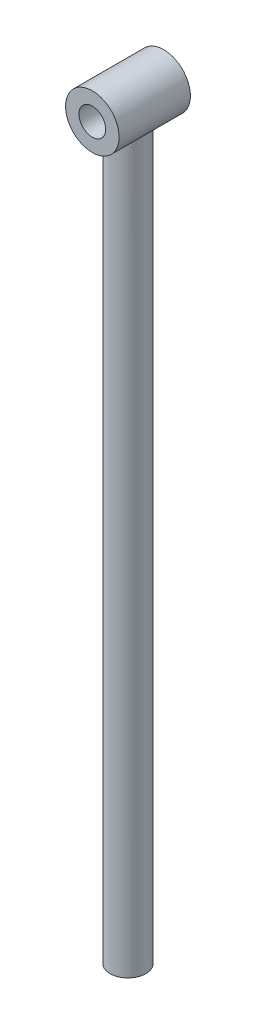
ISO-10303-21;
HEADER;
FILE_DESCRIPTION(('STEP AP214'),'2;1');
FILE_NAME('part.step','',(''),(''),'','','');
FILE_SCHEMA(('AUTOMOTIVE_DESIGN { 1 0 10303 214 1 1 1 1 }'));
ENDSEC;
DATA;
#1=APPLICATION_CONTEXT('core data for automotive mechanical design processes');
#2=APPLICATION_PROTOCOL_DEFINITION('international standard','automotive_design',2000,#1);
#3=PRODUCT_CONTEXT('',#1,'mechanical');
#4=PRODUCT('Part','Part','',(#3));
#5=PRODUCT_RELATED_PRODUCT_CATEGORY('part','',(#4));
#6=PRODUCT_DEFINITION_FORMATION('','',#4);
#7=PRODUCT_DEFINITION_CONTEXT('part definition',#1,'design');
#8=PRODUCT_DEFINITION('design','',#6,#7);
#9=PRODUCT_DEFINITION_SHAPE('','',#8);
#10=(LENGTH_UNIT() NAMED_UNIT(*) SI_UNIT(.MILLI.,.METRE.));
#11=(NAMED_UNIT(*) PLANE_ANGLE_UNIT() SI_UNIT($,.RADIAN.));
#12=(NAMED_UNIT(*) SI_UNIT($,.STERADIAN.) SOLID_ANGLE_UNIT());
#13=UNCERTAINTY_MEASURE_WITH_UNIT(LENGTH_MEASURE(1.E-05),#10,'distance_accuracy_value','');
#14=(GEOMETRIC_REPRESENTATION_CONTEXT(3) GLOBAL_UNCERTAINTY_ASSIGNED_CONTEXT((#13)) GLOBAL_UNIT_ASSIGNED_CONTEXT((#10,
#11,#12)) REPRESENTATION_CONTEXT('',''));
#15=CARTESIAN_POINT('',(0.,0.,0.));
#16=DIRECTION('',(0.,0.,1.));
#17=DIRECTION('',(1.,0.,0.));
#18=AXIS2_PLACEMENT_3D('',#15,#16,#17);
#19=CARTESIAN_POINT('',(0.,407.5,0.));
#20=DIRECTION('',(0.,-1.,0.));
#21=DIRECTION('',(0.,0.,-1.));
#22=AXIS2_PLACEMENT_3D('',#19,#20,#21);
#23=CYLINDRICAL_SURFACE('',#22,20.);
#24=CARTESIAN_POINT('',(0.,-407.5,0.));
#25=DIRECTION('',(0.,1.,0.));
#26=DIRECTION('',(0.,0.,1.));
#27=AXIS2_PLACEMENT_3D('',#24,#25,#26);
#28=CIRCLE('',#27,20.);
#29=CARTESIAN_POINT('',(0.,-407.5,20.));
#30=VERTEX_POINT('',#29);
#31=EDGE_CURVE('E10',#30,#30,#28,.T.);
#32=ORIENTED_EDGE('',*,*,#31,.T.);
#33=EDGE_LOOP('',(#32));
#34=FACE_BOUND('',#33,.T.);
#35=CARTESIAN_POINT('',(-20.,407.5,0.));
#36=CARTESIAN_POINT('',(-19.9999964119226,407.499993881469,0.488208956169299));
#37=CARTESIAN_POINT('',(-19.9820866285813,407.483938202641,0.97646829177405));
#38=CARTESIAN_POINT('',(-19.9108373861768,407.420520366488,1.94835881250642));
#39=CARTESIAN_POINT('',(-19.8574922772833,407.37315321685,2.43198924712351));
#40=CARTESIAN_POINT('',(-19.7163799196857,407.249330081078,3.39112332136816));
#41=CARTESIAN_POINT('',(-19.6285606101057,407.172830105542,3.86661352940438));
#42=CARTESIAN_POINT('',(-19.4200919600602,406.994136325158,4.80533737323532));
#43=CARTESIAN_POINT('',(-19.2994419849513,406.891942023621,5.26857077190594));
#44=CARTESIAN_POINT('',(-19.0284426273943,406.666951548009,6.17578513914899));
#45=CARTESIAN_POINT('',(-18.8783985352891,406.544368954607,6.6199111296105));
#46=CARTESIAN_POINT('',(-18.5495380856481,406.281899591076,7.49212487931458));
#47=CARTESIAN_POINT('',(-18.3707170095788,406.142009984004,7.92020999413464));
#48=CARTESIAN_POINT('',(-17.9858478768931,405.848854181399,8.75912421482547));
#49=CARTESIAN_POINT('',(-17.7798015587787,405.695588840202,9.16995442032434));
#50=CARTESIAN_POINT('',(-17.3417522052945,405.379327250868,9.97362051230805));
#51=CARTESIAN_POINT('',(-17.1097473739498,405.216330329804,10.3664551510918));
#52=CARTESIAN_POINT('',(-16.5827611461459,404.858106096038,11.1932268211757));
#53=CARTESIAN_POINT('',(-16.2835985891376,404.661811794348,11.6240409428177));
#54=CARTESIAN_POINT('',(-15.6533280846079,404.265525325374,12.4598274059487));
#55=CARTESIAN_POINT('',(-15.3222179783466,404.065532908943,12.8647979980787));
#56=CARTESIAN_POINT('',(-14.6288076134715,403.666057781119,13.6481434866574));
#57=CARTESIAN_POINT('',(-14.2664790139786,403.466575705811,14.0264936382841));
#58=CARTESIAN_POINT('',(-13.5118632099609,403.072421135302,14.7548145893199));
#59=CARTESIAN_POINT('',(-13.1195739425843,402.877748972495,15.1047834311923));
#60=CARTESIAN_POINT('',(-12.2471310095378,402.469586628632,15.8231340954399));
#61=CARTESIAN_POINT('',(-11.7624780965832,402.257450921962,16.1868495528045));
#62=CARTESIAN_POINT('',(-10.7570654072488,401.850329707228,16.8717372344808));
#63=CARTESIAN_POINT('',(-10.2363012863295,401.65534626918,17.1929043262227));
#64=CARTESIAN_POINT('',(-9.16171847148809,401.288228630514,17.7887598687195));
#65=CARTESIAN_POINT('',(-8.60792794262454,401.116075353034,18.0634871779264));
#66=CARTESIAN_POINT('',(-7.4705384998476,400.799722899068,18.5627727588207));
#67=CARTESIAN_POINT('',(-6.88694600391358,400.655517735647,18.7873417767955));
#68=CARTESIAN_POINT('',(-5.76165832972233,400.414179819596,19.1602240381012));
#69=CARTESIAN_POINT('',(-5.22260227045826,400.31358203543,19.3142641521887));
#70=CARTESIAN_POINT('',(-4.12906673821278,400.141039062266,19.5772038937651));
#71=CARTESIAN_POINT('',(-3.57458830833749,400.069091940471,19.6861065662819));
#72=CARTESIAN_POINT('',(-2.45588842993638,399.956092266056,19.8566974647913));
#73=CARTESIAN_POINT('',(-1.89167781543662,399.915007374476,19.9184351137685));
#74=CARTESIAN_POINT('',(-0.758659088769605,399.864916470831,19.9936647349202));
#75=CARTESIAN_POINT('',(-0.189851636642891,399.855905932576,20.007163514351));
#76=CARTESIAN_POINT('',(0.859806415927929,399.869132376813,19.9873184370662));
#77=CARTESIAN_POINT('',(1.34086232409546,399.886820411082,19.9607940358833));
#78=CARTESIAN_POINT('',(2.2983895351906,399.945008785724,19.873310019839));
#79=CARTESIAN_POINT('',(2.77486142184121,399.985506181407,19.8123548499873));
#80=CARTESIAN_POINT('',(3.71988287537241,400.088403326163,19.6568520909165));
#81=CARTESIAN_POINT('',(4.18843209759109,400.150804025547,19.5623030441721));
#82=CARTESIAN_POINT('',(5.11455664152083,400.296156324434,19.3408382238798));
#83=CARTESIAN_POINT('',(5.57213148802944,400.379108812098,19.2139210515152));
#84=CARTESIAN_POINT('',(6.47179810816158,400.563481074713,18.9298040334638));
#85=CARTESIAN_POINT('',(6.91394533614489,400.664824284507,18.7727295883957));
#86=CARTESIAN_POINT('',(7.78251525709053,400.884256248497,18.4296096664266));
#87=CARTESIAN_POINT('',(8.20893822800989,401.00234470651,18.2435647019401));
#88=CARTESIAN_POINT('',(9.04431763466509,401.253154002358,17.8441778455769));
#89=CARTESIAN_POINT('',(9.45327362336784,401.38587521438,17.6308352556287));
#90=CARTESIAN_POINT('',(10.2523545489443,401.663725775055,17.1784769804029));
#91=CARTESIAN_POINT('',(10.6424772661187,401.80885658075,16.9394582795807));
#92=CARTESIAN_POINT('',(11.4527356062426,402.128953034818,16.4042840153249));
#93=CARTESIAN_POINT('',(11.8700812163929,402.305333403245,16.1047473885238));
#94=CARTESIAN_POINT('',(12.6780149842778,402.66759262642,15.4767499308217));
#95=CARTESIAN_POINT('',(13.0686011478891,402.853472187254,15.1482869484778));
#96=CARTESIAN_POINT('',(13.8225619123957,403.231469234949,14.4636253470291));
#97=CARTESIAN_POINT('',(14.185896693865,403.423595283726,14.107387635318));
#98=CARTESIAN_POINT('',(14.883843396687,403.810144668192,13.3689696755022));
#99=CARTESIAN_POINT('',(15.2184538830105,404.004568118104,12.9867881329827));
#100=CARTESIAN_POINT('',(15.9077512722913,404.421931040772,12.1362208652914));
#101=CARTESIAN_POINT('',(16.2574779985587,404.64460693453,11.6636681752519));
#102=CARTESIAN_POINT('',(16.9156894234148,405.081343193447,10.6867448691347));
#103=CARTESIAN_POINT('',(17.2241648426868,405.295401612594,10.1823671315698));
#104=CARTESIAN_POINT('',(17.7972680129957,405.707386108483,9.14376134489056));
#105=CARTESIAN_POINT('',(18.0619535936899,405.905333283541,8.60957393087463));
#106=CARTESIAN_POINT('',(18.4241508744694,406.184237346206,7.7871923826137));
#107=CARTESIAN_POINT('',(18.5390641862881,406.274191016331,7.50958963683991));
#108=CARTESIAN_POINT('',(18.7569503816949,406.447090902428,6.94749503984159));
#109=CARTESIAN_POINT('',(18.8599203489511,406.530035405562,6.66300152643999));
#110=CARTESIAN_POINT('',(19.0949737019528,406.721668355833,5.96407091868973));
#111=CARTESIAN_POINT('',(19.2205883140043,406.826129834624,5.54626140545959));
#112=CARTESIAN_POINT('',(19.4450303060951,407.015278355752,4.69922231908339));
#113=CARTESIAN_POINT('',(19.5438649938583,407.099970791804,4.26999589657126));
#114=CARTESIAN_POINT('',(19.7133430846625,407.246598248626,3.40278811100767));
#115=CARTESIAN_POINT('',(19.78402675084,407.308565761701,2.96482019952329));
#116=CARTESIAN_POINT('',(19.8962732778957,407.407529766171,2.08233638909667));
#117=CARTESIAN_POINT('',(19.9378360210846,407.444526156647,1.63782046369868));
#118=CARTESIAN_POINT('',(19.9912114344644,407.492113124786,0.743602003114581));
#119=CARTESIAN_POINT('',(20.0028921020166,407.502586536412,0.293885240116592));
#120=CARTESIAN_POINT('',(19.9958970388908,407.496330466284,-0.605120297999139));
#121=CARTESIAN_POINT('',(19.9772212354264,407.479600919307,-1.0544090720881));
#122=CARTESIAN_POINT('',(19.9098452800438,407.419644392814,-1.94924286023371));
#123=CARTESIAN_POINT('',(19.8611237313693,407.376398530113,-2.3947849767472));
#124=CARTESIAN_POINT('',(19.7344995148557,407.265180410363,-3.27854030433163));
#125=CARTESIAN_POINT('',(19.6565963592159,407.197207739979,-3.71675339276237));
#126=CARTESIAN_POINT('',(19.4773587360434,407.043017262938,-4.56177482159983));
#127=CARTESIAN_POINT('',(19.3773687153742,406.957864100562,-4.96906636618391));
#128=CARTESIAN_POINT('',(19.1532490632813,406.77011012496,-5.77297690486431));
#129=CARTESIAN_POINT('',(19.0291101035355,406.66750257133,-6.16959170710488));
#130=CARTESIAN_POINT('',(18.7579126655137,406.4476244528,-6.95065639455217));
#131=CARTESIAN_POINT('',(18.6108558836455,406.330354973322,-7.33510717762392));
#132=CARTESIAN_POINT('',(18.2949037795792,406.083870826237,-8.09100392305642));
#133=CARTESIAN_POINT('',(18.1260052876392,405.95465442563,-8.46244798787665));
#134=CARTESIAN_POINT('',(17.731501269301,405.660144128327,-9.26453201163457));
#135=CARTESIAN_POINT('',(17.5013086005028,405.492800976277,-9.6921672083065));
#136=CARTESIAN_POINT('',(17.0123139239897,405.148930822038,-10.5268797585094));
#137=CARTESIAN_POINT('',(16.7535092362064,404.972402960344,-10.9339551810086));
#138=CARTESIAN_POINT('',(16.2081390990384,404.613841758583,-11.7272393872389));
#139=CARTESIAN_POINT('',(15.9215439116551,404.431802667528,-12.1134251136209));
#140=CARTESIAN_POINT('',(15.3217576930428,404.065967542722,-12.863686505644));
#141=CARTESIAN_POINT('',(15.0085648790455,403.882171391933,-13.227760686397));
#142=CARTESIAN_POINT('',(14.2850209466698,403.476104916568,-14.010022924438));
#143=CARTESIAN_POINT('',(13.868399953091,403.254209867245,-14.4226354817809));
#144=CARTESIAN_POINT('',(12.9981303927616,402.818388772539,-15.2116275793937));
#145=CARTESIAN_POINT('',(12.5444750407321,402.604464197976,-15.5880004523266));
#146=CARTESIAN_POINT('',(11.6020484650165,402.190167771347,-16.3015809622043));
#147=CARTESIAN_POINT('',(11.1133018111967,401.989786623788,-16.6388155779588));
#148=CARTESIAN_POINT('',(10.1024838029969,401.607688163368,-17.2712189380549));
#149=CARTESIAN_POINT('',(9.58042143890712,401.425965849639,-17.5663989619658));
#150=CARTESIAN_POINT('',(8.60898698059615,401.118850570919,-18.0588559388184));
#151=CARTESIAN_POINT('',(8.16491313347022,400.989342380183,-18.2640476187588));
#152=CARTESIAN_POINT('',(7.25872966066562,400.748301844028,-18.6427436665588));
#153=CARTESIAN_POINT('',(6.79662209756981,400.636767450321,-18.8162516453839));
#154=CARTESIAN_POINT('',(5.85709265439529,400.43407204083,-19.1295452645597));
#155=CARTESIAN_POINT('',(5.37968128385402,400.342897372273,-19.2693535082187));
#156=CARTESIAN_POINT('',(4.41219358714586,400.182861103737,-19.5136219644057));
#157=CARTESIAN_POINT('',(3.92211707735807,400.113999827457,-19.6180816641359));
#158=CARTESIAN_POINT('',(2.93054121015942,399.999968577332,-19.7905605262366));
#159=CARTESIAN_POINT('',(2.42900032455899,399.954906780232,-19.8584133272705));
#160=CARTESIAN_POINT('',(1.42057881685204,399.890073951116,-19.9559150035461));
#161=CARTESIAN_POINT('',(0.913698186293011,399.870302959141,-19.985563818304));
#162=CARTESIAN_POINT('',(-0.101169392531053,399.856558535049,-20.0061827922548));
#163=CARTESIAN_POINT('',(-0.609156273087103,399.862583566089,-19.9971552556599));
#164=CARTESIAN_POINT('',(-1.6219998853204,399.900274149729,-19.9405705458765));
#165=CARTESIAN_POINT('',(-2.12685675839747,399.931938535426,-19.8930151261764));
#166=CARTESIAN_POINT('',(-3.09279975247604,400.016881209177,-19.7649794259347));
#167=CARTESIAN_POINT('',(-3.55439520403422,400.06841684997,-19.687150146037));
#168=CARTESIAN_POINT('',(-4.46836902451357,400.191734722602,-19.5000321223317));
#169=CARTESIAN_POINT('',(-4.92074792756968,400.263515777541,-19.3907452072019));
#170=CARTESIAN_POINT('',(-5.81367709229976,400.425885313285,-19.1419956701691));
#171=CARTESIAN_POINT('',(-6.25422660786601,400.516474977262,-19.0025311498945));
#172=CARTESIAN_POINT('',(-7.12122590088721,400.714737794064,-18.6949126651676));
#173=CARTESIAN_POINT('',(-7.54767493283414,400.82241184842,-18.5267571866793));
#174=CARTESIAN_POINT('',(-8.40878779714676,401.059584584045,-18.1528283168398));
#175=CARTESIAN_POINT('',(-8.84250227551099,401.18998488629,-17.9454426246028));
#176=CARTESIAN_POINT('',(-9.69029143409239,401.465311567327,-17.5022026754717));
#177=CARTESIAN_POINT('',(-10.104365557902,401.610238357291,-17.2663476127158));
#178=CARTESIAN_POINT('',(-10.9116855558948,401.912139034183,-16.7678351398796));
#179=CARTESIAN_POINT('',(-11.3049224388242,402.069118051233,-16.5051663004555));
#180=CARTESIAN_POINT('',(-12.0693531593152,402.392461909335,-15.9547049296104));
#181=CARTESIAN_POINT('',(-12.4405445187535,402.558827801475,-15.6669095826824));
#182=CARTESIAN_POINT('',(-13.2166207315212,402.924963855274,-15.0204704992175));
#183=CARTESIAN_POINT('',(-13.617623044081,403.125872517489,-14.6578028483683));
#184=CARTESIAN_POINT('',(-14.3878567191196,403.532382117264,-13.9025385930368));
#185=CARTESIAN_POINT('',(-14.757083928306,403.737983663796,-13.5099380886709));
#186=CARTESIAN_POINT('',(-15.462918100534,404.14949239823,-12.6960054650691));
#187=CARTESIAN_POINT('',(-15.7995010665117,404.355399699683,-12.2746525915668));
#188=CARTESIAN_POINT('',(-16.4385088149114,404.762494367217,-11.4046784566367));
#189=CARTESIAN_POINT('',(-16.7409369054171,404.963682188907,-10.9560598425279));
#190=CARTESIAN_POINT('',(-17.288437587054,405.341057049452,-10.0678167363029));
#191=CARTESIAN_POINT('',(-17.536125801145,405.51798037407,-9.63011792851657));
#192=CARTESIAN_POINT('',(-17.9996334824726,405.858681305787,-8.73315553064819));
#193=CARTESIAN_POINT('',(-18.2154519906584,406.022458517214,-8.27389129214839));
#194=CARTESIAN_POINT('',(-18.6130511835398,406.331598449548,-7.33576452239174));
#195=CARTESIAN_POINT('',(-18.7948860714089,406.476990372712,-6.85693471063569));
#196=CARTESIAN_POINT('',(-19.1227764985235,406.744359873994,-5.88083845965278));
#197=CARTESIAN_POINT('',(-19.268841780706,406.866343826018,-5.38357708340432));
#198=CARTESIAN_POINT('',(-19.4947592055363,407.057803913261,-4.48539119124869));
#199=CARTESIAN_POINT('',(-19.5821115045836,407.13292547452,-4.08754467830019));
#200=CARTESIAN_POINT('',(-19.7327455746581,407.263584237436,-3.28415884670263));
#201=CARTESIAN_POINT('',(-19.7960310323203,407.319124438533,-2.8786207162801));
#202=CARTESIAN_POINT('',(-19.8976315087765,407.408756094694,-2.06234621278792));
#203=CARTESIAN_POINT('',(-19.9359641063474,407.442862648734,-1.65161370745006));
#204=CARTESIAN_POINT('',(-19.9871514199304,407.48848856574,-0.827266419755445));
#205=CARTESIAN_POINT('',(-20.0000030401181,407.500005184129,-0.413651293298561));
#206=CARTESIAN_POINT('',(-20.,407.5,0.));
#207=B_SPLINE_CURVE_WITH_KNOTS('',3,(#35,#36,#37,#38,#39,#40,#41,#42,#43,#44,#45,#46,#47,#48,
#49,#50,#51,#52,#53,#54,#55,#56,#57,#58,#59,#60,#61,#62,#63,#64,#65,#66,#67,#68,#69,#70,#71,#72,
#73,#74,#75,#76,#77,#78,#79,#80,#81,#82,#83,#84,#85,#86,#87,#88,#89,#90,#91,#92,#93,#94,#95,#96,
#97,#98,#99,#100,#101,#102,#103,#104,#105,#106,#107,#108,#109,#110,#111,#112,#113,#114,#115,
#116,#117,#118,#119,#120,#121,#122,#123,#124,#125,#126,#127,#128,#129,#130,#131,#132,#133,#134,
#135,#136,#137,#138,#139,#140,#141,#142,#143,#144,#145,#146,#147,#148,#149,#150,#151,#152,#153,
#154,#155,#156,#157,#158,#159,#160,#161,#162,#163,#164,#165,#166,#167,#168,#169,#170,#171,#172,
#173,#174,#175,#176,#177,#178,#179,#180,#181,#182,#183,#184,#185,#186,#187,#188,#189,#190,#191,
#192,#193,#194,#195,#196,#197,#198,#199,#200,#201,#202,#203,#204,#205,#206),.UNSPECIFIED.,.T.,
.F.,(4,2,2,2,2,2,2,2,2,2,2,2,2,2,2,2,2,2,2,2,2,2,2,2,2,2,2,2,2,2,2,2,2,2,2,2,2,2,2,2,2,2,2,2,2,
2,2,2,2,2,2,2,2,2,2,2,2,2,2,2,2,2,2,2,2,2,2,2,2,2,2,2,2,2,2,2,2,2,2,2,2,2,2,2,2,4),(0.,
1.46413383476118,2.92850116798432,4.39508846126038,5.86170410688107,7.31382579475255,
8.76618582864001,10.2184531650402,11.6708210407287,13.3493094048912,15.0279112663608,
16.7080533902126,18.3883112996803,20.3117642438544,22.2354490015051,24.1575160629544,
26.0791709305319,27.7853619359246,29.4914378208096,31.1957234922768,32.8997686529781,
34.3443503382155,35.7887455706705,37.2332034782288,38.6777238198782,40.1163627603301,
41.5549762578204,42.9936265517613,44.4324459938663,46.0602839475324,47.6882430766067,
49.3185364037738,50.9489111309836,52.8326361759336,54.7167842470655,56.5984238649026,
57.5389749114896,58.4797551409555,59.8242529017226,61.1683834046849,62.5105844944299,
63.8527910085193,65.2009164973756,66.5490452186684,67.8981351058559,69.2472475454816,
70.529851328563,71.8129515469024,73.0959568335221,74.3791485235474,75.9187799981372,
77.4585558113539,78.999997879572,80.5415433482355,82.4201756779315,84.2991529785491,
86.1768272700558,88.053996993814,89.5706110260009,91.0870521029024,92.6024732144332,
94.1179163090846,95.6401895843999,97.1624652697504,98.6846502640925,100.206765984357,
101.617993966733,103.029139928946,104.440374687427,105.851683940514,107.344548709883,
108.837455746597,110.331001811733,111.824715448892,113.553354854051,115.282219865862,
117.012346298594,118.742305015278,120.340261559248,121.93826618052,123.53369984988,
125.128698469926,126.370149556428,127.611410396842,128.851795845449,130.092331986087),.UNSPECIFIED.);
#208=CARTESIAN_POINT('',(-20.,407.5,0.));
#209=VERTEX_POINT('',#208);
#210=EDGE_CURVE('E47',#209,#209,#207,.T.);
#211=ORIENTED_EDGE('',*,*,#210,.F.);
#212=EDGE_LOOP('',(#211));
#213=FACE_BOUND('',#212,.T.);
#214=ADVANCED_FACE('F39',(#34,#213),#23,.T.);
#215=CARTESIAN_POINT('',(0.,-407.5,0.));
#216=DIRECTION('',(0.,1.,0.));
#217=DIRECTION('',(0.,0.,1.));
#218=AXIS2_PLACEMENT_3D('',#215,#216,#217);
#219=PLANE('',#218);
#220=ORIENTED_EDGE('',*,*,#31,.F.);
#221=EDGE_LOOP('',(#220));
#222=FACE_BOUND('',#221,.T.);
#223=ADVANCED_FACE('F69',(#222),#219,.F.);
#224=CARTESIAN_POINT('',(0.,429.860679774998,40.));
#225=DIRECTION('',(0.,0.,-1.));
#226=DIRECTION('',(-1.,0.,0.));
#227=AXIS2_PLACEMENT_3D('',#224,#225,#226);
#228=CYLINDRICAL_SURFACE('',#227,30.);
#229=CARTESIAN_POINT('',(0.,429.860679774998,40.));
#230=DIRECTION('',(0.,0.,1.));
#231=DIRECTION('',(1.,0.,0.));
#232=AXIS2_PLACEMENT_3D('',#229,#230,#231);
#233=CIRCLE('',#232,30.);
#234=CARTESIAN_POINT('',(30.,429.860679774998,40.));
#235=VERTEX_POINT('',#234);
#236=EDGE_CURVE('E52',#235,#235,#233,.T.);
#237=ORIENTED_EDGE('',*,*,#236,.F.);
#238=EDGE_LOOP('',(#237));
#239=FACE_BOUND('',#238,.T.);
#240=CARTESIAN_POINT('',(0.,429.860679774998,-40.));
#241=DIRECTION('',(0.,0.,1.));
#242=DIRECTION('',(1.,0.,0.));
#243=AXIS2_PLACEMENT_3D('',#240,#241,#242);
#244=CIRCLE('',#243,30.);
#245=CARTESIAN_POINT('',(30.,429.860679774998,-40.));
#246=VERTEX_POINT('',#245);
#247=EDGE_CURVE('E57',#246,#246,#244,.T.);
#248=ORIENTED_EDGE('',*,*,#247,.T.);
#249=EDGE_LOOP('',(#248));
#250=FACE_BOUND('',#249,.T.);
#251=ORIENTED_EDGE('',*,*,#210,.T.);
#252=EDGE_LOOP('',(#251));
#253=FACE_BOUND('',#252,.T.);
#254=ADVANCED_FACE('F64',(#239,#250,#253),#228,.T.);
#255=CARTESIAN_POINT('',(0.,429.860679774998,40.));
#256=DIRECTION('',(0.,0.,1.));
#257=DIRECTION('',(1.,0.,0.));
#258=AXIS2_PLACEMENT_3D('',#255,#256,#257);
#259=PLANE('',#258);
#260=ORIENTED_EDGE('',*,*,#236,.T.);
#261=EDGE_LOOP('',(#260));
#262=FACE_BOUND('',#261,.T.);
#263=CARTESIAN_POINT('',(0.,429.860679774998,40.));
#264=DIRECTION('',(0.,0.,1.));
#265=DIRECTION('',(1.,0.,0.));
#266=AXIS2_PLACEMENT_3D('',#263,#264,#265);
#267=CIRCLE('',#266,15.);
#268=CARTESIAN_POINT('',(15.,429.860679774998,40.));
#269=VERTEX_POINT('',#268);
#270=EDGE_CURVE('E130',#269,#269,#267,.T.);
#271=ORIENTED_EDGE('',*,*,#270,.F.);
#272=EDGE_LOOP('',(#271));
#273=FACE_BOUND('',#272,.T.);
#274=ADVANCED_FACE('F68',(#262,#273),#259,.T.);
#275=CARTESIAN_POINT('',(0.,429.860679774998,-40.));
#276=DIRECTION('',(0.,0.,1.));
#277=DIRECTION('',(1.,0.,0.));
#278=AXIS2_PLACEMENT_3D('',#275,#276,#277);
#279=PLANE('',#278);
#280=ORIENTED_EDGE('',*,*,#247,.F.);
#281=EDGE_LOOP('',(#280));
#282=FACE_BOUND('',#281,.T.);
#283=CARTESIAN_POINT('',(0.,429.860679774998,-40.));
#284=DIRECTION('',(0.,0.,1.));
#285=DIRECTION('',(1.,0.,0.));
#286=AXIS2_PLACEMENT_3D('',#283,#284,#285);
#287=CIRCLE('',#286,15.);
#288=CARTESIAN_POINT('',(15.,429.860679774998,-40.));
#289=VERTEX_POINT('',#288);
#290=EDGE_CURVE('E132',#289,#289,#287,.T.);
#291=ORIENTED_EDGE('',*,*,#290,.T.);
#292=EDGE_LOOP('',(#291));
#293=FACE_BOUND('',#292,.T.);
#294=ADVANCED_FACE('F71',(#282,#293),#279,.F.);
#295=CARTESIAN_POINT('',(0.,429.860679774998,40.));
#296=DIRECTION('',(0.,0.,-1.));
#297=DIRECTION('',(-1.,0.,0.));
#298=AXIS2_PLACEMENT_3D('',#295,#296,#297);
#299=CYLINDRICAL_SURFACE('',#298,15.);
#300=ORIENTED_EDGE('',*,*,#270,.T.);
#301=EDGE_LOOP('',(#300));
#302=FACE_BOUND('',#301,.T.);
#303=ORIENTED_EDGE('',*,*,#290,.F.);
#304=EDGE_LOOP('',(#303));
#305=FACE_BOUND('',#304,.T.);
#306=ADVANCED_FACE('F92',(#302,#305),#299,.F.);
#307=CLOSED_SHELL('',(#214,#223,#254,#274,#294,#306));
#308=MANIFOLD_SOLID_BREP('B2',#307);
#309=ADVANCED_BREP_SHAPE_REPRESENTATION('',(#18,#308),#14);
#310=SHAPE_DEFINITION_REPRESENTATION(#9,#309);
ENDSEC;
END-ISO-10303-21;
